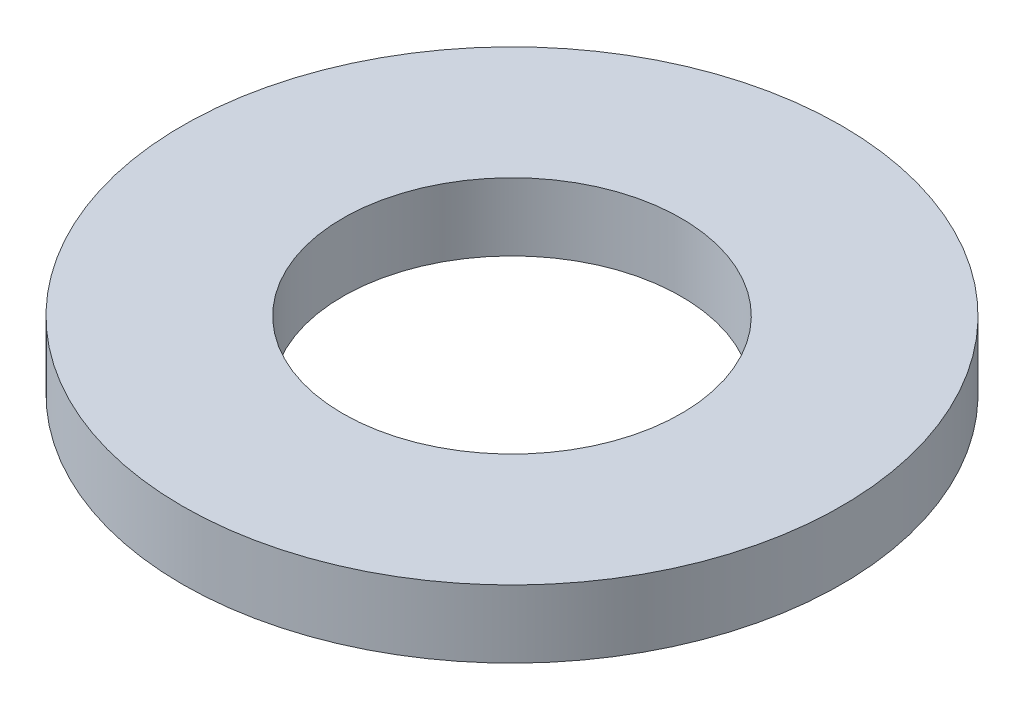
ISO-10303-21;
HEADER;
FILE_DESCRIPTION(('STEP AP214'),'2;1');
FILE_NAME('part.step','',(''),(''),'','','');
FILE_SCHEMA(('AUTOMOTIVE_DESIGN { 1 0 10303 214 1 1 1 1 }'));
ENDSEC;
DATA;
#1=APPLICATION_CONTEXT('core data for automotive mechanical design processes');
#2=APPLICATION_PROTOCOL_DEFINITION('international standard','automotive_design',2000,#1);
#3=PRODUCT_CONTEXT('',#1,'mechanical');
#4=PRODUCT('Part','Part','',(#3));
#5=PRODUCT_RELATED_PRODUCT_CATEGORY('part','',(#4));
#6=PRODUCT_DEFINITION_FORMATION('','',#4);
#7=PRODUCT_DEFINITION_CONTEXT('part definition',#1,'design');
#8=PRODUCT_DEFINITION('design','',#6,#7);
#9=PRODUCT_DEFINITION_SHAPE('','',#8);
#10=(LENGTH_UNIT() NAMED_UNIT(*) SI_UNIT(.MILLI.,.METRE.));
#11=(NAMED_UNIT(*) PLANE_ANGLE_UNIT() SI_UNIT($,.RADIAN.));
#12=(NAMED_UNIT(*) SI_UNIT($,.STERADIAN.) SOLID_ANGLE_UNIT());
#13=UNCERTAINTY_MEASURE_WITH_UNIT(LENGTH_MEASURE(1.E-05),#10,'distance_accuracy_value','');
#14=(GEOMETRIC_REPRESENTATION_CONTEXT(3) GLOBAL_UNCERTAINTY_ASSIGNED_CONTEXT((#13)) GLOBAL_UNIT_ASSIGNED_CONTEXT((#10,
#11,#12)) REPRESENTATION_CONTEXT('',''));
#15=CARTESIAN_POINT('',(0.,0.,0.));
#16=DIRECTION('',(0.,0.,1.));
#17=DIRECTION('',(1.,0.,0.));
#18=AXIS2_PLACEMENT_3D('',#15,#16,#17);
#19=CARTESIAN_POINT('',(0.,19.,0.));
#20=DIRECTION('',(0.,-1.,0.));
#21=DIRECTION('',(0.,0.,-1.));
#22=AXIS2_PLACEMENT_3D('',#19,#20,#21);
#23=CYLINDRICAL_SURFACE('',#22,92.5);
#24=CARTESIAN_POINT('',(0.,19.,0.));
#25=DIRECTION('',(0.,1.,0.));
#26=DIRECTION('',(0.,0.,1.));
#27=AXIS2_PLACEMENT_3D('',#24,#25,#26);
#28=CIRCLE('',#27,92.5);
#29=CARTESIAN_POINT('',(0.,19.,92.5));
#30=VERTEX_POINT('',#29);
#31=EDGE_CURVE('E10',#30,#30,#28,.T.);
#32=ORIENTED_EDGE('',*,*,#31,.F.);
#33=EDGE_LOOP('',(#32));
#34=FACE_BOUND('',#33,.T.);
#35=CARTESIAN_POINT('',(0.,0.,0.));
#36=DIRECTION('',(0.,1.,0.));
#37=DIRECTION('',(0.,0.,1.));
#38=AXIS2_PLACEMENT_3D('',#35,#36,#37);
#39=CIRCLE('',#38,92.5);
#40=CARTESIAN_POINT('',(0.,0.,92.5));
#41=VERTEX_POINT('',#40);
#42=EDGE_CURVE('E37',#41,#41,#39,.T.);
#43=ORIENTED_EDGE('',*,*,#42,.T.);
#44=EDGE_LOOP('',(#43));
#45=FACE_BOUND('',#44,.T.);
#46=ADVANCED_FACE('F40',(#34,#45),#23,.T.);
#47=CARTESIAN_POINT('',(0.,19.,0.));
#48=DIRECTION('',(0.,1.,0.));
#49=DIRECTION('',(0.,0.,1.));
#50=AXIS2_PLACEMENT_3D('',#47,#48,#49);
#51=PLANE('',#50);
#52=CARTESIAN_POINT('',(0.,19.,0.));
#53=DIRECTION('',(0.,1.,0.));
#54=DIRECTION('',(0.,0.,1.));
#55=AXIS2_PLACEMENT_3D('',#52,#53,#54);
#56=CIRCLE('',#55,47.5);
#57=CARTESIAN_POINT('',(0.,19.,47.5));
#58=VERTEX_POINT('',#57);
#59=EDGE_CURVE('E50',#58,#58,#56,.T.);
#60=ORIENTED_EDGE('',*,*,#59,.F.);
#61=EDGE_LOOP('',(#60));
#62=FACE_BOUND('',#61,.T.);
#63=ORIENTED_EDGE('',*,*,#31,.T.);
#64=EDGE_LOOP('',(#63));
#65=FACE_BOUND('',#64,.T.);
#66=ADVANCED_FACE('F59',(#62,#65),#51,.T.);
#67=CARTESIAN_POINT('',(0.,0.,0.));
#68=DIRECTION('',(0.,1.,0.));
#69=DIRECTION('',(0.,0.,1.));
#70=AXIS2_PLACEMENT_3D('',#67,#68,#69);
#71=PLANE('',#70);
#72=CARTESIAN_POINT('',(0.,0.,0.));
#73=DIRECTION('',(0.,1.,0.));
#74=DIRECTION('',(0.,0.,1.));
#75=AXIS2_PLACEMENT_3D('',#72,#73,#74);
#76=CIRCLE('',#75,47.5);
#77=CARTESIAN_POINT('',(0.,0.,47.5));
#78=VERTEX_POINT('',#77);
#79=EDGE_CURVE('E47',#78,#78,#76,.T.);
#80=ORIENTED_EDGE('',*,*,#79,.T.);
#81=EDGE_LOOP('',(#80));
#82=FACE_BOUND('',#81,.T.);
#83=ORIENTED_EDGE('',*,*,#42,.F.);
#84=EDGE_LOOP('',(#83));
#85=FACE_BOUND('',#84,.T.);
#86=ADVANCED_FACE('F58',(#82,#85),#71,.F.);
#87=CARTESIAN_POINT('',(0.,19.,0.));
#88=DIRECTION('',(0.,-1.,0.));
#89=DIRECTION('',(0.,0.,-1.));
#90=AXIS2_PLACEMENT_3D('',#87,#88,#89);
#91=CYLINDRICAL_SURFACE('',#90,47.5);
#92=ORIENTED_EDGE('',*,*,#59,.T.);
#93=EDGE_LOOP('',(#92));
#94=FACE_BOUND('',#93,.T.);
#95=ORIENTED_EDGE('',*,*,#79,.F.);
#96=EDGE_LOOP('',(#95));
#97=FACE_BOUND('',#96,.T.);
#98=ADVANCED_FACE('F54',(#94,#97),#91,.F.);
#99=CLOSED_SHELL('',(#46,#66,#86,#98));
#100=MANIFOLD_SOLID_BREP('B2',#99);
#101=ADVANCED_BREP_SHAPE_REPRESENTATION('',(#18,#100),#14);
#102=SHAPE_DEFINITION_REPRESENTATION(#9,#101);
ENDSEC;
END-ISO-10303-21;
